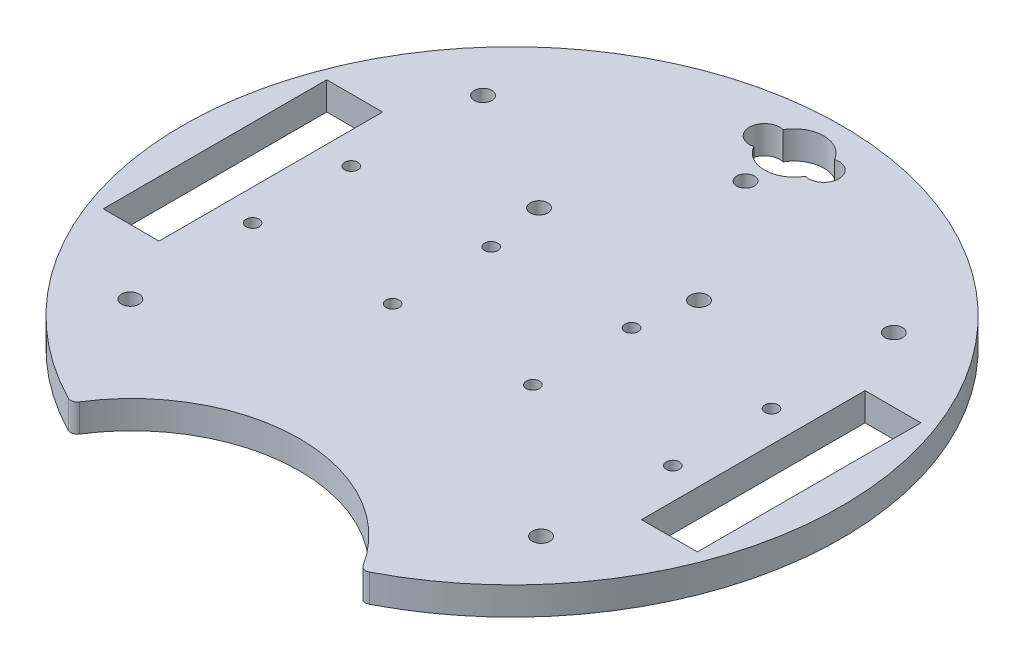
ISO-10303-21;
HEADER;
FILE_DESCRIPTION(('STEP AP214'),'2;1');
FILE_NAME('part.step','',(''),(''),'','','');
FILE_SCHEMA(('AUTOMOTIVE_DESIGN { 1 0 10303 214 1 1 1 1 }'));
ENDSEC;
DATA;
#1=APPLICATION_CONTEXT('core data for automotive mechanical design processes');
#2=APPLICATION_PROTOCOL_DEFINITION('international standard','automotive_design',2000,#1);
#3=PRODUCT_CONTEXT('',#1,'mechanical');
#4=PRODUCT('Part','Part','',(#3));
#5=PRODUCT_RELATED_PRODUCT_CATEGORY('part','',(#4));
#6=PRODUCT_DEFINITION_FORMATION('','',#4);
#7=PRODUCT_DEFINITION_CONTEXT('part definition',#1,'design');
#8=PRODUCT_DEFINITION('design','',#6,#7);
#9=PRODUCT_DEFINITION_SHAPE('','',#8);
#10=(LENGTH_UNIT() NAMED_UNIT(*) SI_UNIT(.MILLI.,.METRE.));
#11=(NAMED_UNIT(*) PLANE_ANGLE_UNIT() SI_UNIT($,.RADIAN.));
#12=(NAMED_UNIT(*) SI_UNIT($,.STERADIAN.) SOLID_ANGLE_UNIT());
#13=UNCERTAINTY_MEASURE_WITH_UNIT(LENGTH_MEASURE(1.E-05),#10,'distance_accuracy_value','');
#14=(GEOMETRIC_REPRESENTATION_CONTEXT(3) GLOBAL_UNCERTAINTY_ASSIGNED_CONTEXT((#13)) GLOBAL_UNIT_ASSIGNED_CONTEXT((#10,
#11,#12)) REPRESENTATION_CONTEXT('',''));
#15=CARTESIAN_POINT('',(0.,0.,0.));
#16=DIRECTION('',(0.,0.,1.));
#17=DIRECTION('',(1.,0.,0.));
#18=AXIS2_PLACEMENT_3D('',#15,#16,#17);
#19=CARTESIAN_POINT('',(0.,6.35,-64.1076988434385));
#20=DIRECTION('',(0.,-1.,0.));
#21=DIRECTION('',(0.,0.,-1.));
#22=AXIS2_PLACEMENT_3D('',#19,#20,#21);
#23=CYLINDRICAL_SURFACE('',#22,6.731);
#24=CARTESIAN_POINT('',(0.,0.,-64.1076988434385));
#25=DIRECTION('',(0.,1.,0.));
#26=DIRECTION('',(0.,0.,1.));
#27=AXIS2_PLACEMENT_3D('',#24,#25,#26);
#28=CIRCLE('',#27,6.731);
#29=CARTESIAN_POINT('',(-5.85389998799957,0.,-60.7853177800295));
#30=VERTEX_POINT('',#29);
#31=CARTESIAN_POINT('',(5.85757547169812,0.,-60.7918021934567));
#32=VERTEX_POINT('',#31);
#33=EDGE_CURVE('E235',#30,#32,#28,.T.);
#34=ORIENTED_EDGE('',*,*,#33,.F.);
#35=DIRECTION('',(0.,-1.,0.));
#36=VECTOR('',#35,1.);
#37=CARTESIAN_POINT('',(-5.85389998799957,6.35,-60.7853177800295));
#38=LINE('',#37,#36);
#39=CARTESIAN_POINT('',(-5.85389998799957,6.35,-60.7853177800295));
#40=VERTEX_POINT('',#39);
#41=EDGE_CURVE('E11',#40,#30,#38,.T.);
#42=ORIENTED_EDGE('',*,*,#41,.F.);
#43=CARTESIAN_POINT('',(0.,6.35,-64.1076988434385));
#44=DIRECTION('',(0.,1.,0.));
#45=DIRECTION('',(0.,0.,1.));
#46=AXIS2_PLACEMENT_3D('',#43,#44,#45);
#47=CIRCLE('',#46,6.731);
#48=CARTESIAN_POINT('',(5.85757547169812,6.35,-60.7918021934567));
#49=VERTEX_POINT('',#48);
#50=EDGE_CURVE('E169',#40,#49,#47,.T.);
#51=ORIENTED_EDGE('',*,*,#50,.T.);
#52=DIRECTION('',(0.,-1.,0.));
#53=VECTOR('',#52,1.);
#54=CARTESIAN_POINT('',(5.85757547169812,6.35,-60.7918021934567));
#55=LINE('',#54,#53);
#56=EDGE_CURVE('E52',#49,#32,#55,.T.);
#57=ORIENTED_EDGE('',*,*,#56,.T.);
#58=EDGE_LOOP('',(#34,#42,#51,#57));
#59=FACE_BOUND('',#58,.T.);
#60=ADVANCED_FACE('F33',(#59),#23,.F.);
#61=CARTESIAN_POINT('',(-6.731,6.35,-64.1076988434385));
#62=DIRECTION('',(0.,-1.,0.));
#63=DIRECTION('',(0.,0.,-1.));
#64=AXIS2_PLACEMENT_3D('',#61,#62,#63);
#65=CYLINDRICAL_SURFACE('',#64,3.43620726405579);
#66=CARTESIAN_POINT('',(-6.731,0.,-64.1076988434385));
#67=DIRECTION('',(0.,1.,0.));
#68=DIRECTION('',(0.,0.,1.));
#69=AXIS2_PLACEMENT_3D('',#66,#67,#68);
#70=CIRCLE('',#69,3.43620726405579);
#71=CARTESIAN_POINT('',(-5.85389998799957,0.,-67.4300799068475));
#72=VERTEX_POINT('',#71);
#73=EDGE_CURVE('E157',#72,#30,#70,.T.);
#74=ORIENTED_EDGE('',*,*,#73,.F.);
#75=DIRECTION('',(0.,-1.,0.));
#76=VECTOR('',#75,1.);
#77=CARTESIAN_POINT('',(-5.85389998799957,6.35,-67.4300799068475));
#78=LINE('',#77,#76);
#79=CARTESIAN_POINT('',(-5.85389998799957,6.35,-67.4300799068475));
#80=VERTEX_POINT('',#79);
#81=EDGE_CURVE('E43',#80,#72,#78,.T.);
#82=ORIENTED_EDGE('',*,*,#81,.F.);
#83=CARTESIAN_POINT('',(-6.731,6.35,-64.1076988434385));
#84=DIRECTION('',(0.,1.,0.));
#85=DIRECTION('',(0.,0.,1.));
#86=AXIS2_PLACEMENT_3D('',#83,#84,#85);
#87=CIRCLE('',#86,3.43620726405579);
#88=EDGE_CURVE('E155',#80,#40,#87,.T.);
#89=ORIENTED_EDGE('',*,*,#88,.T.);
#90=ORIENTED_EDGE('',*,*,#41,.T.);
#91=EDGE_LOOP('',(#74,#82,#89,#90));
#92=FACE_BOUND('',#91,.T.);
#93=ADVANCED_FACE('F154',(#92),#65,.F.);
#94=CARTESIAN_POINT('',(0.,6.35,-64.1076988434385));
#95=DIRECTION('',(0.,-1.,0.));
#96=DIRECTION('',(0.,0.,-1.));
#97=AXIS2_PLACEMENT_3D('',#94,#95,#96);
#98=CYLINDRICAL_SURFACE('',#97,6.731);
#99=CARTESIAN_POINT('',(0.,0.,-64.1076988434385));
#100=DIRECTION('',(0.,1.,0.));
#101=DIRECTION('',(0.,0.,1.));
#102=AXIS2_PLACEMENT_3D('',#99,#100,#101);
#103=CIRCLE('',#102,6.731);
#104=CARTESIAN_POINT('',(5.8575754716981,0.,-67.4235954934203));
#105=VERTEX_POINT('',#104);
#106=EDGE_CURVE('E238',#105,#72,#103,.T.);
#107=ORIENTED_EDGE('',*,*,#106,.F.);
#108=DIRECTION('',(0.,-1.,0.));
#109=VECTOR('',#108,1.);
#110=CARTESIAN_POINT('',(5.8575754716981,6.35,-67.4235954934203));
#111=LINE('',#110,#109);
#112=CARTESIAN_POINT('',(5.8575754716981,6.35,-67.4235954934203));
#113=VERTEX_POINT('',#112);
#114=EDGE_CURVE('E101',#113,#105,#111,.T.);
#115=ORIENTED_EDGE('',*,*,#114,.F.);
#116=CARTESIAN_POINT('',(0.,6.35,-64.1076988434385));
#117=DIRECTION('',(0.,1.,0.));
#118=DIRECTION('',(0.,0.,1.));
#119=AXIS2_PLACEMENT_3D('',#116,#117,#118);
#120=CIRCLE('',#119,6.731);
#121=EDGE_CURVE('E168',#113,#80,#120,.T.);
#122=ORIENTED_EDGE('',*,*,#121,.T.);
#123=ORIENTED_EDGE('',*,*,#81,.T.);
#124=EDGE_LOOP('',(#107,#115,#122,#123));
#125=FACE_BOUND('',#124,.T.);
#126=ADVANCED_FACE('F171',(#125),#98,.F.);
#127=CARTESIAN_POINT('',(0.,6.35,-25.4000000000001));
#128=DIRECTION('',(0.,0.,-1.));
#129=DIRECTION('',(-1.,0.,0.));
#130=AXIS2_PLACEMENT_3D('',#127,#128,#129);
#131=PLANE('',#130);
#132=DIRECTION('',(1.,0.,0.));
#133=VECTOR('',#132,1.);
#134=CARTESIAN_POINT('',(0.,0.,-25.4000000000001));
#135=LINE('',#134,#133);
#136=CARTESIAN_POINT('',(-67.5141237268841,0.,-25.4000000000001));
#137=VERTEX_POINT('',#136);
#138=CARTESIAN_POINT('',(-54.8141237268841,0.,-25.4000000000001));
#139=VERTEX_POINT('',#138);
#140=EDGE_CURVE('E224',#137,#139,#135,.T.);
#141=ORIENTED_EDGE('',*,*,#140,.T.);
#142=DIRECTION('',(0.,-1.,0.));
#143=VECTOR('',#142,1.);
#144=CARTESIAN_POINT('',(-54.8141237268841,6.35,-25.4000000000001));
#145=LINE('',#144,#143);
#146=CARTESIAN_POINT('',(-54.8141237268841,6.35,-25.4000000000001));
#147=VERTEX_POINT('',#146);
#148=EDGE_CURVE('E251',#147,#139,#145,.T.);
#149=ORIENTED_EDGE('',*,*,#148,.F.);
#150=DIRECTION('',(1.,0.,0.));
#151=VECTOR('',#150,1.);
#152=CARTESIAN_POINT('',(0.,6.35,-25.4000000000001));
#153=LINE('',#152,#151);
#154=CARTESIAN_POINT('',(-67.5141237268841,6.35,-25.4000000000001));
#155=VERTEX_POINT('',#154);
#156=EDGE_CURVE('E688',#155,#147,#153,.T.);
#157=ORIENTED_EDGE('',*,*,#156,.F.);
#158=DIRECTION('',(0.,-1.,0.));
#159=VECTOR('',#158,1.);
#160=CARTESIAN_POINT('',(-67.5141237268841,6.35,-25.4000000000001));
#161=LINE('',#160,#159);
#162=EDGE_CURVE('E253',#155,#137,#161,.T.);
#163=ORIENTED_EDGE('',*,*,#162,.T.);
#164=EDGE_LOOP('',(#141,#149,#157,#163));
#165=FACE_BOUND('',#164,.T.);
#166=ADVANCED_FACE('F329',(#165),#131,.F.);
#167=CARTESIAN_POINT('',(-54.8141237268841,6.35,0.));
#168=DIRECTION('',(1.,0.,0.));
#169=DIRECTION('',(0.,0.,-1.));
#170=AXIS2_PLACEMENT_3D('',#167,#168,#169);
#171=PLANE('',#170);
#172=DIRECTION('',(0.,0.,1.));
#173=VECTOR('',#172,1.);
#174=CARTESIAN_POINT('',(-54.8141237268841,0.,0.));
#175=LINE('',#174,#173);
#176=CARTESIAN_POINT('',(-54.8141237268841,0.,25.3999999999999));
#177=VERTEX_POINT('',#176);
#178=EDGE_CURVE('E227',#139,#177,#175,.T.);
#179=ORIENTED_EDGE('',*,*,#178,.T.);
#180=DIRECTION('',(0.,-1.,0.));
#181=VECTOR('',#180,1.);
#182=CARTESIAN_POINT('',(-54.8141237268841,6.35,25.3999999999999));
#183=LINE('',#182,#181);
#184=CARTESIAN_POINT('',(-54.8141237268841,6.35,25.3999999999999));
#185=VERTEX_POINT('',#184);
#186=EDGE_CURVE('E259',#185,#177,#183,.T.);
#187=ORIENTED_EDGE('',*,*,#186,.F.);
#188=DIRECTION('',(0.,0.,1.));
#189=VECTOR('',#188,1.);
#190=CARTESIAN_POINT('',(-54.8141237268841,6.35,0.));
#191=LINE('',#190,#189);
#192=EDGE_CURVE('E691',#147,#185,#191,.T.);
#193=ORIENTED_EDGE('',*,*,#192,.F.);
#194=ORIENTED_EDGE('',*,*,#148,.T.);
#195=EDGE_LOOP('',(#179,#187,#193,#194));
#196=FACE_BOUND('',#195,.T.);
#197=ADVANCED_FACE('F325',(#196),#171,.F.);
#198=CARTESIAN_POINT('',(0.,6.35,25.3999999999999));
#199=DIRECTION('',(0.,0.,-1.));
#200=DIRECTION('',(-1.,0.,0.));
#201=AXIS2_PLACEMENT_3D('',#198,#199,#200);
#202=PLANE('',#201);
#203=DIRECTION('',(1.,0.,0.));
#204=VECTOR('',#203,1.);
#205=CARTESIAN_POINT('',(0.,0.,25.3999999999999));
#206=LINE('',#205,#204);
#207=CARTESIAN_POINT('',(-67.5141237268841,0.,25.3999999999999));
#208=VERTEX_POINT('',#207);
#209=EDGE_CURVE('E230',#208,#177,#206,.T.);
#210=ORIENTED_EDGE('',*,*,#209,.F.);
#211=DIRECTION('',(0.,-1.,0.));
#212=VECTOR('',#211,1.);
#213=CARTESIAN_POINT('',(-67.5141237268841,6.35,25.3999999999999));
#214=LINE('',#213,#212);
#215=CARTESIAN_POINT('',(-67.5141237268841,6.35,25.3999999999999));
#216=VERTEX_POINT('',#215);
#217=EDGE_CURVE('E256',#216,#208,#214,.T.);
#218=ORIENTED_EDGE('',*,*,#217,.F.);
#219=DIRECTION('',(1.,0.,0.));
#220=VECTOR('',#219,1.);
#221=CARTESIAN_POINT('',(0.,6.35,25.3999999999999));
#222=LINE('',#221,#220);
#223=EDGE_CURVE('E693',#216,#185,#222,.T.);
#224=ORIENTED_EDGE('',*,*,#223,.T.);
#225=ORIENTED_EDGE('',*,*,#186,.T.);
#226=EDGE_LOOP('',(#210,#218,#224,#225));
#227=FACE_BOUND('',#226,.T.);
#228=ADVANCED_FACE('F321',(#227),#202,.T.);
#229=CARTESIAN_POINT('',(67.5141237268841,6.35,0.));
#230=DIRECTION('',(-1.,0.,0.));
#231=DIRECTION('',(0.,0.,1.));
#232=AXIS2_PLACEMENT_3D('',#229,#230,#231);
#233=PLANE('',#232);
#234=DIRECTION('',(0.,0.,-1.));
#235=VECTOR('',#234,1.);
#236=CARTESIAN_POINT('',(67.5141237268841,0.,0.));
#237=LINE('',#236,#235);
#238=CARTESIAN_POINT('',(67.5141237268841,0.,25.3999999999999));
#239=VERTEX_POINT('',#238);
#240=CARTESIAN_POINT('',(67.5141237268841,0.,-25.4000000000001));
#241=VERTEX_POINT('',#240);
#242=EDGE_CURVE('E212',#239,#241,#237,.T.);
#243=ORIENTED_EDGE('',*,*,#242,.F.);
#244=DIRECTION('',(0.,-1.,0.));
#245=VECTOR('',#244,1.);
#246=CARTESIAN_POINT('',(67.5141237268841,6.35,25.3999999999999));
#247=LINE('',#246,#245);
#248=CARTESIAN_POINT('',(67.5141237268841,6.35,25.3999999999999));
#249=VERTEX_POINT('',#248);
#250=EDGE_CURVE('E257',#249,#239,#247,.T.);
#251=ORIENTED_EDGE('',*,*,#250,.F.);
#252=DIRECTION('',(0.,0.,-1.));
#253=VECTOR('',#252,1.);
#254=CARTESIAN_POINT('',(67.5141237268841,6.35,0.));
#255=LINE('',#254,#253);
#256=CARTESIAN_POINT('',(67.5141237268841,6.35,-25.4000000000001));
#257=VERTEX_POINT('',#256);
#258=EDGE_CURVE('E677',#249,#257,#255,.T.);
#259=ORIENTED_EDGE('',*,*,#258,.T.);
#260=DIRECTION('',(0.,-1.,0.));
#261=VECTOR('',#260,1.);
#262=CARTESIAN_POINT('',(67.5141237268841,6.35,-25.4000000000001));
#263=LINE('',#262,#261);
#264=EDGE_CURVE('E263',#257,#241,#263,.T.);
#265=ORIENTED_EDGE('',*,*,#264,.T.);
#266=EDGE_LOOP('',(#243,#251,#259,#265));
#267=FACE_BOUND('',#266,.T.);
#268=ADVANCED_FACE('F324',(#267),#233,.T.);
#269=CARTESIAN_POINT('',(0.,6.35,25.3999999999999));
#270=DIRECTION('',(0.,0.,1.));
#271=DIRECTION('',(1.,0.,0.));
#272=AXIS2_PLACEMENT_3D('',#269,#270,#271);
#273=PLANE('',#272);
#274=DIRECTION('',(-1.,0.,0.));
#275=VECTOR('',#274,1.);
#276=CARTESIAN_POINT('',(0.,0.,25.3999999999999));
#277=LINE('',#276,#275);
#278=CARTESIAN_POINT('',(54.8141237268841,0.,25.3999999999999));
#279=VERTEX_POINT('',#278);
#280=EDGE_CURVE('E215',#239,#279,#277,.T.);
#281=ORIENTED_EDGE('',*,*,#280,.T.);
#282=DIRECTION('',(0.,-1.,0.));
#283=VECTOR('',#282,1.);
#284=CARTESIAN_POINT('',(54.8141237268841,6.35,25.3999999999999));
#285=LINE('',#284,#283);
#286=CARTESIAN_POINT('',(54.8141237268841,6.35,25.3999999999999));
#287=VERTEX_POINT('',#286);
#288=EDGE_CURVE('E267',#287,#279,#285,.T.);
#289=ORIENTED_EDGE('',*,*,#288,.F.);
#290=DIRECTION('',(-1.,0.,0.));
#291=VECTOR('',#290,1.);
#292=CARTESIAN_POINT('',(0.,6.35,25.3999999999999));
#293=LINE('',#292,#291);
#294=EDGE_CURVE('E680',#249,#287,#293,.T.);
#295=ORIENTED_EDGE('',*,*,#294,.F.);
#296=ORIENTED_EDGE('',*,*,#250,.T.);
#297=EDGE_LOOP('',(#281,#289,#295,#296));
#298=FACE_BOUND('',#297,.T.);
#299=ADVANCED_FACE('F341',(#298),#273,.F.);
#300=CARTESIAN_POINT('',(54.8141237268841,6.35,0.));
#301=DIRECTION('',(-1.,0.,0.));
#302=DIRECTION('',(0.,0.,1.));
#303=AXIS2_PLACEMENT_3D('',#300,#301,#302);
#304=PLANE('',#303);
#305=DIRECTION('',(0.,0.,-1.));
#306=VECTOR('',#305,1.);
#307=CARTESIAN_POINT('',(54.8141237268841,0.,0.));
#308=LINE('',#307,#306);
#309=CARTESIAN_POINT('',(54.8141237268841,0.,-25.4000000000001));
#310=VERTEX_POINT('',#309);
#311=EDGE_CURVE('E218',#279,#310,#308,.T.);
#312=ORIENTED_EDGE('',*,*,#311,.T.);
#313=DIRECTION('',(0.,-1.,0.));
#314=VECTOR('',#313,1.);
#315=CARTESIAN_POINT('',(54.8141237268841,6.35,-25.4000000000001));
#316=LINE('',#315,#314);
#317=CARTESIAN_POINT('',(54.8141237268841,6.35,-25.4000000000001));
#318=VERTEX_POINT('',#317);
#319=EDGE_CURVE('E265',#318,#310,#316,.T.);
#320=ORIENTED_EDGE('',*,*,#319,.F.);
#321=DIRECTION('',(0.,0.,-1.));
#322=VECTOR('',#321,1.);
#323=CARTESIAN_POINT('',(54.8141237268841,6.35,0.));
#324=LINE('',#323,#322);
#325=EDGE_CURVE('E683',#287,#318,#324,.T.);
#326=ORIENTED_EDGE('',*,*,#325,.F.);
#327=ORIENTED_EDGE('',*,*,#288,.T.);
#328=EDGE_LOOP('',(#312,#320,#326,#327));
#329=FACE_BOUND('',#328,.T.);
#330=ADVANCED_FACE('F338',(#329),#304,.F.);
#331=CARTESIAN_POINT('',(33.5100001196225,6.35,65.3012960955778));
#332=DIRECTION('',(0.,-1.,0.));
#333=DIRECTION('',(0.,0.,-1.));
#334=AXIS2_PLACEMENT_3D('',#331,#332,#333);
#335=CYLINDRICAL_SURFACE('',#334,1.50000000000011);
#336=CARTESIAN_POINT('',(33.5100001196225,0.,65.3012960955778));
#337=DIRECTION('',(0.,1.,0.));
#338=DIRECTION('',(0.,0.,1.));
#339=AXIS2_PLACEMENT_3D('',#336,#337,#338);
#340=CIRCLE('',#339,1.50000000000011);
#341=CARTESIAN_POINT('',(34.1948335778492,0.,66.6358383895849));
#342=VERTEX_POINT('',#341);
#343=CARTESIAN_POINT('',(32.2406819332729,0.,66.100565350462));
#344=VERTEX_POINT('',#343);
#345=EDGE_CURVE('E191',#342,#344,#340,.F.);
#346=ORIENTED_EDGE('',*,*,#345,.F.);
#347=DIRECTION('',(0.,-1.,0.));
#348=VECTOR('',#347,1.);
#349=CARTESIAN_POINT('',(34.1948335778492,6.35,66.6358383895849));
#350=LINE('',#349,#348);
#351=CARTESIAN_POINT('',(34.1948335778492,6.35,66.6358383895849));
#352=VERTEX_POINT('',#351);
#353=EDGE_CURVE('E37',#352,#342,#350,.T.);
#354=ORIENTED_EDGE('',*,*,#353,.F.);
#355=CARTESIAN_POINT('',(33.5100001196225,6.35,65.3012960955778));
#356=DIRECTION('',(0.,1.,0.));
#357=DIRECTION('',(0.,0.,1.));
#358=AXIS2_PLACEMENT_3D('',#355,#356,#357);
#359=CIRCLE('',#358,1.50000000000011);
#360=CARTESIAN_POINT('',(32.2406819332729,6.35,66.100565350462));
#361=VERTEX_POINT('',#360);
#362=EDGE_CURVE('E288',#352,#361,#359,.F.);
#363=ORIENTED_EDGE('',*,*,#362,.T.);
#364=DIRECTION('',(0.,-1.,0.));
#365=VECTOR('',#364,1.);
#366=CARTESIAN_POINT('',(32.2406819332729,6.35,66.100565350462));
#367=LINE('',#366,#365);
#368=EDGE_CURVE('E183',#361,#344,#367,.T.);
#369=ORIENTED_EDGE('',*,*,#368,.T.);
#370=EDGE_LOOP('',(#346,#354,#363,#369));
#371=FACE_BOUND('',#370,.T.);
#372=ADVANCED_FACE('F287',(#371),#335,.T.);
#373=CARTESIAN_POINT('',(0.,6.35,0.));
#374=DIRECTION('',(0.,-1.,0.));
#375=DIRECTION('',(0.,0.,-1.));
#376=AXIS2_PLACEMENT_3D('',#373,#374,#375);
#377=CYLINDRICAL_SURFACE('',#376,74.8974071734108);
#378=CARTESIAN_POINT('',(0.,0.,0.));
#379=DIRECTION('',(0.,1.,0.));
#380=DIRECTION('',(0.,0.,1.));
#381=AXIS2_PLACEMENT_3D('',#378,#379,#380);
#382=CIRCLE('',#381,74.8974071734108);
#383=CARTESIAN_POINT('',(-34.1948335778492,0.,66.6358383895849));
#384=VERTEX_POINT('',#383);
#385=EDGE_CURVE('E194',#342,#384,#382,.T.);
#386=ORIENTED_EDGE('',*,*,#385,.T.);
#387=DIRECTION('',(0.,-1.,0.));
#388=VECTOR('',#387,1.);
#389=CARTESIAN_POINT('',(-34.1948335778492,6.35,66.6358383895849));
#390=LINE('',#389,#388);
#391=CARTESIAN_POINT('',(-34.1948335778492,6.35,66.6358383895849));
#392=VERTEX_POINT('',#391);
#393=EDGE_CURVE('E273',#392,#384,#390,.T.);
#394=ORIENTED_EDGE('',*,*,#393,.F.);
#395=CARTESIAN_POINT('',(0.,6.35,0.));
#396=DIRECTION('',(0.,1.,0.));
#397=DIRECTION('',(0.,0.,1.));
#398=AXIS2_PLACEMENT_3D('',#395,#396,#397);
#399=CIRCLE('',#398,74.8974071734108);
#400=EDGE_CURVE('E281',#352,#392,#399,.T.);
#401=ORIENTED_EDGE('',*,*,#400,.F.);
#402=ORIENTED_EDGE('',*,*,#353,.T.);
#403=EDGE_LOOP('',(#386,#394,#401,#402));
#404=FACE_BOUND('',#403,.T.);
#405=ADVANCED_FACE('F279',(#404),#377,.T.);
#406=CARTESIAN_POINT('',(-33.5100001196225,6.35,65.3012960955779));
#407=DIRECTION('',(0.,-1.,0.));
#408=DIRECTION('',(0.,0.,-1.));
#409=AXIS2_PLACEMENT_3D('',#406,#407,#408);
#410=CYLINDRICAL_SURFACE('',#409,1.50000000000026);
#411=CARTESIAN_POINT('',(-33.5100001196225,0.,65.3012960955779));
#412=DIRECTION('',(0.,1.,0.));
#413=DIRECTION('',(0.,0.,1.));
#414=AXIS2_PLACEMENT_3D('',#411,#412,#413);
#415=CIRCLE('',#414,1.50000000000026);
#416=CARTESIAN_POINT('',(-32.2406819332729,0.,66.100565350462));
#417=VERTEX_POINT('',#416);
#418=EDGE_CURVE('E197',#384,#417,#415,.T.);
#419=ORIENTED_EDGE('',*,*,#418,.T.);
#420=DIRECTION('',(0.,-1.,0.));
#421=VECTOR('',#420,1.);
#422=CARTESIAN_POINT('',(-32.2406819332729,6.35,66.100565350462));
#423=LINE('',#422,#421);
#424=CARTESIAN_POINT('',(-32.2406819332729,6.35,66.100565350462));
#425=VERTEX_POINT('',#424);
#426=EDGE_CURVE('E272',#425,#417,#423,.T.);
#427=ORIENTED_EDGE('',*,*,#426,.F.);
#428=CARTESIAN_POINT('',(-33.5100001196225,6.35,65.3012960955779));
#429=DIRECTION('',(0.,1.,0.));
#430=DIRECTION('',(0.,0.,1.));
#431=AXIS2_PLACEMENT_3D('',#428,#429,#430);
#432=CIRCLE('',#431,1.50000000000026);
#433=EDGE_CURVE('E665',#392,#425,#432,.T.);
#434=ORIENTED_EDGE('',*,*,#433,.F.);
#435=ORIENTED_EDGE('',*,*,#393,.T.);
#436=EDGE_LOOP('',(#419,#427,#434,#435));
#437=FACE_BOUND('',#436,.T.);
#438=ADVANCED_FACE('F295',(#437),#410,.T.);
#439=CARTESIAN_POINT('',(-18.1789527954067,6.35,-24.3105510962522));
#440=DIRECTION('',(0.,-1.,0.));
#441=DIRECTION('',(0.,0.,-1.));
#442=AXIS2_PLACEMENT_3D('',#439,#440,#441);
#443=CYLINDRICAL_SURFACE('',#442,2.);
#444=CARTESIAN_POINT('',(-18.1789527954067,6.35,-24.3105510962522));
#445=DIRECTION('',(0.,1.,0.));
#446=DIRECTION('',(0.,0.,1.));
#447=AXIS2_PLACEMENT_3D('',#444,#445,#446);
#448=CIRCLE('',#447,2.);
#449=CARTESIAN_POINT('',(-18.1789527954067,6.35,-22.3105510962522));
#450=VERTEX_POINT('',#449);
#451=EDGE_CURVE('E174',#450,#450,#448,.F.);
#452=ORIENTED_EDGE('',*,*,#451,.F.);
#453=EDGE_LOOP('',(#452));
#454=FACE_BOUND('',#453,.T.);
#455=CARTESIAN_POINT('',(-18.1789527954067,0.,-24.3105510962522));
#456=DIRECTION('',(0.,1.,0.));
#457=DIRECTION('',(0.,0.,1.));
#458=AXIS2_PLACEMENT_3D('',#455,#456,#457);
#459=CIRCLE('',#458,2.);
#460=CARTESIAN_POINT('',(-18.1789527954067,0.,-22.3105510962522));
#461=VERTEX_POINT('',#460);
#462=EDGE_CURVE('E243',#461,#461,#459,.F.);
#463=ORIENTED_EDGE('',*,*,#462,.T.);
#464=EDGE_LOOP('',(#463));
#465=FACE_BOUND('',#464,.T.);
#466=ADVANCED_FACE('F297',(#454,#465),#443,.F.);
#467=CARTESIAN_POINT('',(6.731,6.35,-64.1076988434385));
#468=DIRECTION('',(0.,-1.,0.));
#469=DIRECTION('',(0.,0.,-1.));
#470=AXIS2_PLACEMENT_3D('',#467,#468,#469);
#471=CYLINDRICAL_SURFACE('',#470,3.429);
#472=CARTESIAN_POINT('',(6.731,0.,-64.1076988434385));
#473=DIRECTION('',(0.,1.,0.));
#474=DIRECTION('',(0.,0.,1.));
#475=AXIS2_PLACEMENT_3D('',#472,#473,#474);
#476=CIRCLE('',#475,3.429);
#477=EDGE_CURVE('E240',#32,#105,#476,.T.);
#478=ORIENTED_EDGE('',*,*,#477,.F.);
#479=ORIENTED_EDGE('',*,*,#56,.F.);
#480=CARTESIAN_POINT('',(6.731,6.35,-64.1076988434385));
#481=DIRECTION('',(0.,1.,0.));
#482=DIRECTION('',(0.,0.,1.));
#483=AXIS2_PLACEMENT_3D('',#480,#481,#482);
#484=CIRCLE('',#483,3.429);
#485=EDGE_CURVE('E172',#49,#113,#484,.T.);
#486=ORIENTED_EDGE('',*,*,#485,.T.);
#487=ORIENTED_EDGE('',*,*,#114,.T.);
#488=EDGE_LOOP('',(#478,#479,#486,#487));
#489=FACE_BOUND('',#488,.T.);
#490=ADVANCED_FACE('F303',(#489),#471,.F.);
#491=CARTESIAN_POINT('',(-67.5141237268841,6.35,0.));
#492=DIRECTION('',(-1.,0.,0.));
#493=DIRECTION('',(0.,0.,1.));
#494=AXIS2_PLACEMENT_3D('',#491,#492,#493);
#495=PLANE('',#494);
#496=DIRECTION('',(0.,0.,-1.));
#497=VECTOR('',#496,1.);
#498=CARTESIAN_POINT('',(-67.5141237268841,0.,0.));
#499=LINE('',#498,#497);
#500=EDGE_CURVE('E233',#208,#137,#499,.T.);
#501=ORIENTED_EDGE('',*,*,#500,.T.);
#502=ORIENTED_EDGE('',*,*,#162,.F.);
#503=DIRECTION('',(0.,0.,-1.));
#504=VECTOR('',#503,1.);
#505=CARTESIAN_POINT('',(-67.5141237268841,6.35,0.));
#506=LINE('',#505,#504);
#507=EDGE_CURVE('E696',#216,#155,#506,.T.);
#508=ORIENTED_EDGE('',*,*,#507,.F.);
#509=ORIENTED_EDGE('',*,*,#217,.T.);
#510=EDGE_LOOP('',(#501,#502,#508,#509));
#511=FACE_BOUND('',#510,.T.);
#512=ADVANCED_FACE('F316',(#511),#495,.F.);
#513=CARTESIAN_POINT('',(0.,6.35,-25.4000000000001));
#514=DIRECTION('',(0.,0.,1.));
#515=DIRECTION('',(1.,0.,0.));
#516=AXIS2_PLACEMENT_3D('',#513,#514,#515);
#517=PLANE('',#516);
#518=DIRECTION('',(-1.,0.,0.));
#519=VECTOR('',#518,1.);
#520=CARTESIAN_POINT('',(0.,0.,-25.4000000000001));
#521=LINE('',#520,#519);
#522=EDGE_CURVE('E221',#241,#310,#521,.T.);
#523=ORIENTED_EDGE('',*,*,#522,.F.);
#524=ORIENTED_EDGE('',*,*,#264,.F.);
#525=DIRECTION('',(-1.,0.,0.));
#526=VECTOR('',#525,1.);
#527=CARTESIAN_POINT('',(0.,6.35,-25.4000000000001));
#528=LINE('',#527,#526);
#529=EDGE_CURVE('E685',#257,#318,#528,.T.);
#530=ORIENTED_EDGE('',*,*,#529,.T.);
#531=ORIENTED_EDGE('',*,*,#319,.T.);
#532=EDGE_LOOP('',(#523,#524,#530,#531));
#533=FACE_BOUND('',#532,.T.);
#534=ADVANCED_FACE('F319',(#533),#517,.T.);
#535=CARTESIAN_POINT('',(-46.6637339832601,6.35,40.0812318826666));
#536=DIRECTION('',(0.,-1.,0.));
#537=DIRECTION('',(0.,0.,-1.));
#538=AXIS2_PLACEMENT_3D('',#535,#536,#537);
#539=CYLINDRICAL_SURFACE('',#538,2.);
#540=CARTESIAN_POINT('',(-46.6637339832601,6.35,40.0812318826666));
#541=DIRECTION('',(0.,1.,0.));
#542=DIRECTION('',(0.,0.,1.));
#543=AXIS2_PLACEMENT_3D('',#540,#541,#542);
#544=CIRCLE('',#543,2.);
#545=CARTESIAN_POINT('',(-46.6637339832601,6.35,42.0812318826666));
#546=VERTEX_POINT('',#545);
#547=EDGE_CURVE('E674',#546,#546,#544,.T.);
#548=ORIENTED_EDGE('',*,*,#547,.T.);
#549=EDGE_LOOP('',(#548));
#550=FACE_BOUND('',#549,.T.);
#551=CARTESIAN_POINT('',(-46.6637339832601,0.,40.0812318826666));
#552=DIRECTION('',(0.,1.,0.));
#553=DIRECTION('',(0.,0.,1.));
#554=AXIS2_PLACEMENT_3D('',#551,#552,#553);
#555=CIRCLE('',#554,2.);
#556=CARTESIAN_POINT('',(-46.6637339832601,0.,42.0812318826666));
#557=VERTEX_POINT('',#556);
#558=EDGE_CURVE('E209',#557,#557,#555,.T.);
#559=ORIENTED_EDGE('',*,*,#558,.F.);
#560=EDGE_LOOP('',(#559));
#561=FACE_BOUND('',#560,.T.);
#562=ADVANCED_FACE('F336',(#550,#561),#539,.F.);
#563=CARTESIAN_POINT('',(46.6637339832601,6.35,40.0812318826666));
#564=DIRECTION('',(0.,-1.,0.));
#565=DIRECTION('',(0.,0.,-1.));
#566=AXIS2_PLACEMENT_3D('',#563,#564,#565);
#567=CYLINDRICAL_SURFACE('',#566,2.);
#568=CARTESIAN_POINT('',(46.6637339832601,6.35,40.0812318826666));
#569=DIRECTION('',(0.,1.,0.));
#570=DIRECTION('',(0.,0.,1.));
#571=AXIS2_PLACEMENT_3D('',#568,#569,#570);
#572=CIRCLE('',#571,2.);
#573=CARTESIAN_POINT('',(46.6637339832601,6.35,42.0812318826666));
#574=VERTEX_POINT('',#573);
#575=EDGE_CURVE('E671',#574,#574,#572,.T.);
#576=ORIENTED_EDGE('',*,*,#575,.T.);
#577=EDGE_LOOP('',(#576));
#578=FACE_BOUND('',#577,.T.);
#579=CARTESIAN_POINT('',(46.6637339832601,0.,40.0812318826666));
#580=DIRECTION('',(0.,1.,0.));
#581=DIRECTION('',(0.,0.,1.));
#582=AXIS2_PLACEMENT_3D('',#579,#580,#581);
#583=CIRCLE('',#582,2.);
#584=CARTESIAN_POINT('',(46.6637339832601,0.,42.0812318826666));
#585=VERTEX_POINT('',#584);
#586=EDGE_CURVE('E206',#585,#585,#583,.T.);
#587=ORIENTED_EDGE('',*,*,#586,.F.);
#588=EDGE_LOOP('',(#587));
#589=FACE_BOUND('',#588,.T.);
#590=ADVANCED_FACE('F351',(#578,#589),#567,.F.);
#591=CARTESIAN_POINT('',(46.6637339832601,6.35,-40.0812318826666));
#592=DIRECTION('',(0.,-1.,0.));
#593=DIRECTION('',(0.,0.,-1.));
#594=AXIS2_PLACEMENT_3D('',#591,#592,#593);
#595=CYLINDRICAL_SURFACE('',#594,2.);
#596=CARTESIAN_POINT('',(46.6637339832601,6.35,-40.0812318826666));
#597=DIRECTION('',(0.,1.,0.));
#598=DIRECTION('',(0.,0.,1.));
#599=AXIS2_PLACEMENT_3D('',#596,#597,#598);
#600=CIRCLE('',#599,2.);
#601=CARTESIAN_POINT('',(46.6637339832601,6.35,-38.0812318826666));
#602=VERTEX_POINT('',#601);
#603=EDGE_CURVE('E668',#602,#602,#600,.F.);
#604=ORIENTED_EDGE('',*,*,#603,.F.);
#605=EDGE_LOOP('',(#604));
#606=FACE_BOUND('',#605,.T.);
#607=CARTESIAN_POINT('',(46.6637339832601,0.,-40.0812318826666));
#608=DIRECTION('',(0.,1.,0.));
#609=DIRECTION('',(0.,0.,1.));
#610=AXIS2_PLACEMENT_3D('',#607,#608,#609);
#611=CIRCLE('',#610,2.);
#612=CARTESIAN_POINT('',(46.6637339832601,0.,-38.0812318826666));
#613=VERTEX_POINT('',#612);
#614=EDGE_CURVE('E203',#613,#613,#611,.F.);
#615=ORIENTED_EDGE('',*,*,#614,.T.);
#616=EDGE_LOOP('',(#615));
#617=FACE_BOUND('',#616,.T.);
#618=ADVANCED_FACE('F355',(#606,#617),#595,.F.);
#619=CARTESIAN_POINT('',(0.,6.35,86.4020044245157));
#620=DIRECTION('',(0.,-1.,0.));
#621=DIRECTION('',(0.,0.,-1.));
#622=AXIS2_PLACEMENT_3D('',#619,#620,#621);
#623=CYLINDRICAL_SURFACE('',#622,38.0999999999998);
#624=CARTESIAN_POINT('',(0.,0.,86.4020044245157));
#625=DIRECTION('',(0.,1.,0.));
#626=DIRECTION('',(0.,0.,1.));
#627=AXIS2_PLACEMENT_3D('',#624,#625,#626);
#628=CIRCLE('',#627,38.0999999999998);
#629=EDGE_CURVE('E200',#344,#417,#628,.T.);
#630=ORIENTED_EDGE('',*,*,#629,.F.);
#631=ORIENTED_EDGE('',*,*,#368,.F.);
#632=CARTESIAN_POINT('',(0.,6.35,86.4020044245157));
#633=DIRECTION('',(0.,1.,0.));
#634=DIRECTION('',(0.,0.,1.));
#635=AXIS2_PLACEMENT_3D('',#632,#633,#634);
#636=CIRCLE('',#635,38.0999999999998);
#637=EDGE_CURVE('E293',#361,#425,#636,.T.);
#638=ORIENTED_EDGE('',*,*,#637,.T.);
#639=ORIENTED_EDGE('',*,*,#426,.T.);
#640=EDGE_LOOP('',(#630,#631,#638,#639));
#641=FACE_BOUND('',#640,.T.);
#642=ADVANCED_FACE('F292',(#641),#623,.F.);
#643=CARTESIAN_POINT('',(18.1789527954067,6.35,-24.3105510962522));
#644=DIRECTION('',(0.,-1.,0.));
#645=DIRECTION('',(0.,0.,-1.));
#646=AXIS2_PLACEMENT_3D('',#643,#644,#645);
#647=CYLINDRICAL_SURFACE('',#646,2.);
#648=CARTESIAN_POINT('',(18.1789527954067,6.35,-24.3105510962522));
#649=DIRECTION('',(0.,1.,0.));
#650=DIRECTION('',(0.,0.,1.));
#651=AXIS2_PLACEMENT_3D('',#648,#649,#650);
#652=CIRCLE('',#651,2.);
#653=CARTESIAN_POINT('',(18.1789527954067,6.35,-22.3105510962522));
#654=VERTEX_POINT('',#653);
#655=EDGE_CURVE('E661',#654,#654,#652,.T.);
#656=ORIENTED_EDGE('',*,*,#655,.T.);
#657=EDGE_LOOP('',(#656));
#658=FACE_BOUND('',#657,.T.);
#659=CARTESIAN_POINT('',(18.1789527954067,0.,-24.3105510962522));
#660=DIRECTION('',(0.,1.,0.));
#661=DIRECTION('',(0.,0.,1.));
#662=AXIS2_PLACEMENT_3D('',#659,#660,#661);
#663=CIRCLE('',#662,2.);
#664=CARTESIAN_POINT('',(18.1789527954067,0.,-22.3105510962522));
#665=VERTEX_POINT('',#664);
#666=EDGE_CURVE('E187',#665,#665,#663,.T.);
#667=ORIENTED_EDGE('',*,*,#666,.F.);
#668=EDGE_LOOP('',(#667));
#669=FACE_BOUND('',#668,.T.);
#670=ADVANCED_FACE('F360',(#658,#669),#647,.F.);
#671=CARTESIAN_POINT('',(0.,6.35,-53.0611879648997));
#672=DIRECTION('',(0.,-1.,0.));
#673=DIRECTION('',(0.,0.,-1.));
#674=AXIS2_PLACEMENT_3D('',#671,#672,#673);
#675=CYLINDRICAL_SURFACE('',#674,2.);
#676=CARTESIAN_POINT('',(0.,6.35,-53.0611879648997));
#677=DIRECTION('',(0.,1.,0.));
#678=DIRECTION('',(0.,0.,1.));
#679=AXIS2_PLACEMENT_3D('',#676,#677,#678);
#680=CIRCLE('',#679,2.);
#681=CARTESIAN_POINT('',(0.,6.35,-51.0611879648997));
#682=VERTEX_POINT('',#681);
#683=EDGE_CURVE('E249',#682,#682,#680,.T.);
#684=ORIENTED_EDGE('',*,*,#683,.T.);
#685=EDGE_LOOP('',(#684));
#686=FACE_BOUND('',#685,.T.);
#687=CARTESIAN_POINT('',(0.,0.,-53.0611879648997));
#688=DIRECTION('',(0.,1.,0.));
#689=DIRECTION('',(0.,0.,1.));
#690=AXIS2_PLACEMENT_3D('',#687,#688,#689);
#691=CIRCLE('',#690,2.);
#692=CARTESIAN_POINT('',(0.,0.,-51.0611879648997));
#693=VERTEX_POINT('',#692);
#694=EDGE_CURVE('E184',#693,#693,#691,.T.);
#695=ORIENTED_EDGE('',*,*,#694,.F.);
#696=EDGE_LOOP('',(#695));
#697=FACE_BOUND('',#696,.T.);
#698=ADVANCED_FACE('F35',(#686,#697),#675,.F.);
#699=CARTESIAN_POINT('',(-46.6637339832601,6.35,-40.0812318826666));
#700=DIRECTION('',(0.,-1.,0.));
#701=DIRECTION('',(0.,0.,-1.));
#702=AXIS2_PLACEMENT_3D('',#699,#700,#701);
#703=CYLINDRICAL_SURFACE('',#702,2.);
#704=CARTESIAN_POINT('',(-46.6637339832601,6.35,-40.0812318826666));
#705=DIRECTION('',(0.,1.,0.));
#706=DIRECTION('',(0.,0.,1.));
#707=AXIS2_PLACEMENT_3D('',#704,#705,#706);
#708=CIRCLE('',#707,2.);
#709=CARTESIAN_POINT('',(-46.6637339832601,6.35,-38.0812318826666));
#710=VERTEX_POINT('',#709);
#711=EDGE_CURVE('E180',#710,#710,#708,.F.);
#712=ORIENTED_EDGE('',*,*,#711,.F.);
#713=EDGE_LOOP('',(#712));
#714=FACE_BOUND('',#713,.T.);
#715=CARTESIAN_POINT('',(-46.6637339832601,0.,-40.0812318826666));
#716=DIRECTION('',(0.,1.,0.));
#717=DIRECTION('',(0.,0.,1.));
#718=AXIS2_PLACEMENT_3D('',#715,#716,#717);
#719=CIRCLE('',#718,2.);
#720=CARTESIAN_POINT('',(-46.6637339832601,0.,-38.0812318826666));
#721=VERTEX_POINT('',#720);
#722=EDGE_CURVE('E246',#721,#721,#719,.F.);
#723=ORIENTED_EDGE('',*,*,#722,.T.);
#724=EDGE_LOOP('',(#723));
#725=FACE_BOUND('',#724,.T.);
#726=ADVANCED_FACE('F368',(#714,#725),#703,.F.);
#727=CARTESIAN_POINT('',(0.,6.35,0.));
#728=DIRECTION('',(0.,1.,0.));
#729=DIRECTION('',(0.,0.,1.));
#730=AXIS2_PLACEMENT_3D('',#727,#728,#729);
#731=PLANE('',#730);
#732=CARTESIAN_POINT('',(47.7457373660715,6.35,-11.205));
#733=DIRECTION('',(0.,1.,0.));
#734=DIRECTION('',(0.,0.,1.));
#735=AXIS2_PLACEMENT_3D('',#732,#733,#734);
#736=CIRCLE('',#735,1.5);
#737=CARTESIAN_POINT('',(47.7457373660715,6.35,-9.70499999999998));
#738=VERTEX_POINT('',#737);
#739=EDGE_CURVE('E611',#738,#738,#736,.F.);
#740=ORIENTED_EDGE('',*,*,#739,.T.);
#741=EDGE_LOOP('',(#740));
#742=FACE_BOUND('',#741,.T.);
#743=CARTESIAN_POINT('',(47.7457373660715,6.35,11.205));
#744=DIRECTION('',(0.,1.,0.));
#745=DIRECTION('',(0.,0.,1.));
#746=AXIS2_PLACEMENT_3D('',#743,#744,#745);
#747=CIRCLE('',#746,1.50000000000001);
#748=CARTESIAN_POINT('',(47.7457373660715,6.35,12.705));
#749=VERTEX_POINT('',#748);
#750=EDGE_CURVE('E621',#749,#749,#747,.F.);
#751=ORIENTED_EDGE('',*,*,#750,.T.);
#752=EDGE_LOOP('',(#751));
#753=FACE_BOUND('',#752,.T.);
#754=CARTESIAN_POINT('',(15.9457373660715,6.35,-11.2050000000004));
#755=DIRECTION('',(0.,1.,0.));
#756=DIRECTION('',(0.,0.,1.));
#757=AXIS2_PLACEMENT_3D('',#754,#755,#756);
#758=CIRCLE('',#757,1.5);
#759=CARTESIAN_POINT('',(15.9457373660715,6.35,-9.70500000000042));
#760=VERTEX_POINT('',#759);
#761=EDGE_CURVE('E627',#760,#760,#758,.F.);
#762=ORIENTED_EDGE('',*,*,#761,.T.);
#763=EDGE_LOOP('',(#762));
#764=FACE_BOUND('',#763,.T.);
#765=CARTESIAN_POINT('',(15.9457373660715,6.35,11.2050000000004));
#766=DIRECTION('',(0.,1.,0.));
#767=DIRECTION('',(0.,0.,1.));
#768=AXIS2_PLACEMENT_3D('',#765,#766,#767);
#769=CIRCLE('',#768,1.5);
#770=CARTESIAN_POINT('',(15.9457373660715,6.35,12.7050000000004));
#771=VERTEX_POINT('',#770);
#772=EDGE_CURVE('E633',#771,#771,#769,.F.);
#773=ORIENTED_EDGE('',*,*,#772,.T.);
#774=EDGE_LOOP('',(#773));
#775=FACE_BOUND('',#774,.T.);
#776=CARTESIAN_POINT('',(-15.9457373660715,6.35,11.2050000000004));
#777=DIRECTION('',(0.,1.,0.));
#778=DIRECTION('',(0.,0.,1.));
#779=AXIS2_PLACEMENT_3D('',#776,#777,#778);
#780=CIRCLE('',#779,1.5);
#781=CARTESIAN_POINT('',(-15.9457373660715,6.35,12.7050000000004));
#782=VERTEX_POINT('',#781);
#783=EDGE_CURVE('E639',#782,#782,#780,.F.);
#784=ORIENTED_EDGE('',*,*,#783,.T.);
#785=EDGE_LOOP('',(#784));
#786=FACE_BOUND('',#785,.T.);
#787=CARTESIAN_POINT('',(-15.9457373660715,6.35,-11.2050000000004));
#788=DIRECTION('',(0.,1.,0.));
#789=DIRECTION('',(0.,0.,1.));
#790=AXIS2_PLACEMENT_3D('',#787,#788,#789);
#791=CIRCLE('',#790,1.5);
#792=CARTESIAN_POINT('',(-15.9457373660715,6.35,-9.70500000000042));
#793=VERTEX_POINT('',#792);
#794=EDGE_CURVE('E645',#793,#793,#791,.F.);
#795=ORIENTED_EDGE('',*,*,#794,.T.);
#796=EDGE_LOOP('',(#795));
#797=FACE_BOUND('',#796,.T.);
#798=CARTESIAN_POINT('',(-47.7457373660715,6.35,11.205));
#799=DIRECTION('',(0.,1.,0.));
#800=DIRECTION('',(0.,0.,1.));
#801=AXIS2_PLACEMENT_3D('',#798,#799,#800);
#802=CIRCLE('',#801,1.50000000000001);
#803=CARTESIAN_POINT('',(-47.7457373660715,6.35,12.705));
#804=VERTEX_POINT('',#803);
#805=EDGE_CURVE('E651',#804,#804,#802,.F.);
#806=ORIENTED_EDGE('',*,*,#805,.T.);
#807=EDGE_LOOP('',(#806));
#808=FACE_BOUND('',#807,.T.);
#809=CARTESIAN_POINT('',(-47.7457373660715,6.35,-11.205));
#810=DIRECTION('',(0.,1.,0.));
#811=DIRECTION('',(0.,0.,1.));
#812=AXIS2_PLACEMENT_3D('',#809,#810,#811);
#813=CIRCLE('',#812,1.5);
#814=CARTESIAN_POINT('',(-47.7457373660715,6.35,-9.70499999999999));
#815=VERTEX_POINT('',#814);
#816=EDGE_CURVE('E188',#815,#815,#813,.F.);
#817=ORIENTED_EDGE('',*,*,#816,.T.);
#818=EDGE_LOOP('',(#817));
#819=FACE_BOUND('',#818,.T.);
#820=ORIENTED_EDGE('',*,*,#683,.F.);
#821=EDGE_LOOP('',(#820));
#822=FACE_BOUND('',#821,.T.);
#823=ORIENTED_EDGE('',*,*,#655,.F.);
#824=EDGE_LOOP('',(#823));
#825=FACE_BOUND('',#824,.T.);
#826=ORIENTED_EDGE('',*,*,#362,.F.);
#827=ORIENTED_EDGE('',*,*,#400,.T.);
#828=ORIENTED_EDGE('',*,*,#433,.T.);
#829=ORIENTED_EDGE('',*,*,#637,.F.);
#830=EDGE_LOOP('',(#826,#827,#828,#829));
#831=FACE_BOUND('',#830,.T.);
#832=ORIENTED_EDGE('',*,*,#603,.T.);
#833=EDGE_LOOP('',(#832));
#834=FACE_BOUND('',#833,.T.);
#835=ORIENTED_EDGE('',*,*,#575,.F.);
#836=EDGE_LOOP('',(#835));
#837=FACE_BOUND('',#836,.T.);
#838=ORIENTED_EDGE('',*,*,#547,.F.);
#839=EDGE_LOOP('',(#838));
#840=FACE_BOUND('',#839,.T.);
#841=ORIENTED_EDGE('',*,*,#258,.F.);
#842=ORIENTED_EDGE('',*,*,#294,.T.);
#843=ORIENTED_EDGE('',*,*,#325,.T.);
#844=ORIENTED_EDGE('',*,*,#529,.F.);
#845=EDGE_LOOP('',(#841,#842,#843,#844));
#846=FACE_BOUND('',#845,.T.);
#847=ORIENTED_EDGE('',*,*,#156,.T.);
#848=ORIENTED_EDGE('',*,*,#192,.T.);
#849=ORIENTED_EDGE('',*,*,#223,.F.);
#850=ORIENTED_EDGE('',*,*,#507,.T.);
#851=EDGE_LOOP('',(#847,#848,#849,#850));
#852=FACE_BOUND('',#851,.T.);
#853=ORIENTED_EDGE('',*,*,#50,.F.);
#854=ORIENTED_EDGE('',*,*,#88,.F.);
#855=ORIENTED_EDGE('',*,*,#121,.F.);
#856=ORIENTED_EDGE('',*,*,#485,.F.);
#857=EDGE_LOOP('',(#853,#854,#855,#856));
#858=FACE_BOUND('',#857,.T.);
#859=ORIENTED_EDGE('',*,*,#451,.T.);
#860=EDGE_LOOP('',(#859));
#861=FACE_BOUND('',#860,.T.);
#862=ORIENTED_EDGE('',*,*,#711,.T.);
#863=EDGE_LOOP('',(#862));
#864=FACE_BOUND('',#863,.T.);
#865=ADVANCED_FACE('F165',(#742,#753,#764,#775,#786,#797,#808,#819,#822,#825,#831,#834,#837,
#840,#846,#852,#858,#861,#864),#731,.T.);
#866=CARTESIAN_POINT('',(0.,0.,0.));
#867=DIRECTION('',(0.,1.,0.));
#868=DIRECTION('',(0.,0.,1.));
#869=AXIS2_PLACEMENT_3D('',#866,#867,#868);
#870=PLANE('',#869);
#871=CARTESIAN_POINT('',(47.7457373660715,0.,-11.205));
#872=DIRECTION('',(0.,1.,0.));
#873=DIRECTION('',(0.,0.,-1.));
#874=AXIS2_PLACEMENT_3D('',#871,#872,#873);
#875=CIRCLE('',#874,1.5);
#876=CARTESIAN_POINT('',(47.7457373660715,0.,-12.705));
#877=VERTEX_POINT('',#876);
#878=EDGE_CURVE('E614',#877,#877,#875,.T.);
#879=ORIENTED_EDGE('',*,*,#878,.T.);
#880=EDGE_LOOP('',(#879));
#881=FACE_BOUND('',#880,.T.);
#882=CARTESIAN_POINT('',(47.7457373660715,0.,11.205));
#883=DIRECTION('',(0.,1.,0.));
#884=DIRECTION('',(0.,0.,1.));
#885=AXIS2_PLACEMENT_3D('',#882,#883,#884);
#886=CIRCLE('',#885,1.50000000000001);
#887=CARTESIAN_POINT('',(47.7457373660715,0.,12.705));
#888=VERTEX_POINT('',#887);
#889=EDGE_CURVE('E616',#888,#888,#886,.T.);
#890=ORIENTED_EDGE('',*,*,#889,.T.);
#891=EDGE_LOOP('',(#890));
#892=FACE_BOUND('',#891,.T.);
#893=CARTESIAN_POINT('',(15.9457373660715,0.,-11.2050000000004));
#894=DIRECTION('',(0.,1.,0.));
#895=DIRECTION('',(0.,0.,-1.));
#896=AXIS2_PLACEMENT_3D('',#893,#894,#895);
#897=CIRCLE('',#896,1.5);
#898=CARTESIAN_POINT('',(15.9457373660715,0.,-12.7050000000004));
#899=VERTEX_POINT('',#898);
#900=EDGE_CURVE('E624',#899,#899,#897,.T.);
#901=ORIENTED_EDGE('',*,*,#900,.T.);
#902=EDGE_LOOP('',(#901));
#903=FACE_BOUND('',#902,.T.);
#904=CARTESIAN_POINT('',(15.9457373660715,0.,11.2050000000004));
#905=DIRECTION('',(0.,1.,0.));
#906=DIRECTION('',(0.,0.,1.));
#907=AXIS2_PLACEMENT_3D('',#904,#905,#906);
#908=CIRCLE('',#907,1.5);
#909=CARTESIAN_POINT('',(15.9457373660715,0.,12.7050000000004));
#910=VERTEX_POINT('',#909);
#911=EDGE_CURVE('E630',#910,#910,#908,.T.);
#912=ORIENTED_EDGE('',*,*,#911,.T.);
#913=EDGE_LOOP('',(#912));
#914=FACE_BOUND('',#913,.T.);
#915=CARTESIAN_POINT('',(-15.9457373660715,0.,11.2050000000004));
#916=DIRECTION('',(0.,1.,0.));
#917=DIRECTION('',(0.,0.,-1.));
#918=AXIS2_PLACEMENT_3D('',#915,#916,#917);
#919=CIRCLE('',#918,1.5);
#920=CARTESIAN_POINT('',(-15.9457373660715,0.,9.70500000000043));
#921=VERTEX_POINT('',#920);
#922=EDGE_CURVE('E636',#921,#921,#919,.T.);
#923=ORIENTED_EDGE('',*,*,#922,.T.);
#924=EDGE_LOOP('',(#923));
#925=FACE_BOUND('',#924,.T.);
#926=CARTESIAN_POINT('',(-15.9457373660715,0.,-11.2050000000004));
#927=DIRECTION('',(0.,1.,0.));
#928=DIRECTION('',(0.,0.,1.));
#929=AXIS2_PLACEMENT_3D('',#926,#927,#928);
#930=CIRCLE('',#929,1.5);
#931=CARTESIAN_POINT('',(-15.9457373660715,0.,-9.70500000000042));
#932=VERTEX_POINT('',#931);
#933=EDGE_CURVE('E642',#932,#932,#930,.T.);
#934=ORIENTED_EDGE('',*,*,#933,.T.);
#935=EDGE_LOOP('',(#934));
#936=FACE_BOUND('',#935,.T.);
#937=CARTESIAN_POINT('',(-47.7457373660715,0.,11.205));
#938=DIRECTION('',(0.,1.,0.));
#939=DIRECTION('',(0.,0.,-1.));
#940=AXIS2_PLACEMENT_3D('',#937,#938,#939);
#941=CIRCLE('',#940,1.50000000000001);
#942=CARTESIAN_POINT('',(-47.7457373660715,0.,9.70499999999999));
#943=VERTEX_POINT('',#942);
#944=EDGE_CURVE('E648',#943,#943,#941,.T.);
#945=ORIENTED_EDGE('',*,*,#944,.T.);
#946=EDGE_LOOP('',(#945));
#947=FACE_BOUND('',#946,.T.);
#948=CARTESIAN_POINT('',(-47.7457373660715,0.,-11.205));
#949=DIRECTION('',(0.,1.,0.));
#950=DIRECTION('',(0.,0.,1.));
#951=AXIS2_PLACEMENT_3D('',#948,#949,#950);
#952=CIRCLE('',#951,1.5);
#953=CARTESIAN_POINT('',(-47.7457373660715,0.,-9.70499999999999));
#954=VERTEX_POINT('',#953);
#955=EDGE_CURVE('E654',#954,#954,#952,.T.);
#956=ORIENTED_EDGE('',*,*,#955,.T.);
#957=EDGE_LOOP('',(#956));
#958=FACE_BOUND('',#957,.T.);
#959=ORIENTED_EDGE('',*,*,#694,.T.);
#960=EDGE_LOOP('',(#959));
#961=FACE_BOUND('',#960,.T.);
#962=ORIENTED_EDGE('',*,*,#666,.T.);
#963=EDGE_LOOP('',(#962));
#964=FACE_BOUND('',#963,.T.);
#965=ORIENTED_EDGE('',*,*,#345,.T.);
#966=ORIENTED_EDGE('',*,*,#629,.T.);
#967=ORIENTED_EDGE('',*,*,#418,.F.);
#968=ORIENTED_EDGE('',*,*,#385,.F.);
#969=EDGE_LOOP('',(#965,#966,#967,#968));
#970=FACE_BOUND('',#969,.T.);
#971=ORIENTED_EDGE('',*,*,#614,.F.);
#972=EDGE_LOOP('',(#971));
#973=FACE_BOUND('',#972,.T.);
#974=ORIENTED_EDGE('',*,*,#586,.T.);
#975=EDGE_LOOP('',(#974));
#976=FACE_BOUND('',#975,.T.);
#977=ORIENTED_EDGE('',*,*,#558,.T.);
#978=EDGE_LOOP('',(#977));
#979=FACE_BOUND('',#978,.T.);
#980=ORIENTED_EDGE('',*,*,#242,.T.);
#981=ORIENTED_EDGE('',*,*,#522,.T.);
#982=ORIENTED_EDGE('',*,*,#311,.F.);
#983=ORIENTED_EDGE('',*,*,#280,.F.);
#984=EDGE_LOOP('',(#980,#981,#982,#983));
#985=FACE_BOUND('',#984,.T.);
#986=ORIENTED_EDGE('',*,*,#140,.F.);
#987=ORIENTED_EDGE('',*,*,#500,.F.);
#988=ORIENTED_EDGE('',*,*,#209,.T.);
#989=ORIENTED_EDGE('',*,*,#178,.F.);
#990=EDGE_LOOP('',(#986,#987,#988,#989));
#991=FACE_BOUND('',#990,.T.);
#992=ORIENTED_EDGE('',*,*,#33,.T.);
#993=ORIENTED_EDGE('',*,*,#477,.T.);
#994=ORIENTED_EDGE('',*,*,#106,.T.);
#995=ORIENTED_EDGE('',*,*,#73,.T.);
#996=EDGE_LOOP('',(#992,#993,#994,#995));
#997=FACE_BOUND('',#996,.T.);
#998=ORIENTED_EDGE('',*,*,#462,.F.);
#999=EDGE_LOOP('',(#998));
#1000=FACE_BOUND('',#999,.T.);
#1001=ORIENTED_EDGE('',*,*,#722,.F.);
#1002=EDGE_LOOP('',(#1001));
#1003=FACE_BOUND('',#1002,.T.);
#1004=ADVANCED_FACE('F284',(#881,#892,#903,#914,#925,#936,#947,#958,#961,#964,#970,#973,#976,
#979,#985,#991,#997,#1000,#1003),#870,.F.);
#1005=CARTESIAN_POINT('',(-47.7457373660715,10.,-11.205));
#1006=DIRECTION('',(0.,-1.,0.));
#1007=DIRECTION('',(0.,0.,-1.));
#1008=AXIS2_PLACEMENT_3D('',#1005,#1006,#1007);
#1009=CYLINDRICAL_SURFACE('',#1008,1.5);
#1010=ORIENTED_EDGE('',*,*,#816,.F.);
#1011=EDGE_LOOP('',(#1010));
#1012=FACE_BOUND('',#1011,.T.);
#1013=ORIENTED_EDGE('',*,*,#955,.F.);
#1014=EDGE_LOOP('',(#1013));
#1015=FACE_BOUND('',#1014,.T.);
#1016=ADVANCED_FACE('F471',(#1012,#1015),#1009,.F.);
#1017=CARTESIAN_POINT('',(-47.7457373660715,10.,11.205));
#1018=DIRECTION('',(0.,-1.,0.));
#1019=DIRECTION('',(0.,0.,-1.));
#1020=AXIS2_PLACEMENT_3D('',#1017,#1018,#1019);
#1021=CYLINDRICAL_SURFACE('',#1020,1.50000000000001);
#1022=ORIENTED_EDGE('',*,*,#805,.F.);
#1023=EDGE_LOOP('',(#1022));
#1024=FACE_BOUND('',#1023,.T.);
#1025=ORIENTED_EDGE('',*,*,#944,.F.);
#1026=EDGE_LOOP('',(#1025));
#1027=FACE_BOUND('',#1026,.T.);
#1028=ADVANCED_FACE('F481',(#1024,#1027),#1021,.F.);
#1029=CARTESIAN_POINT('',(-15.9457373660715,10.,-11.2050000000004));
#1030=DIRECTION('',(0.,-1.,0.));
#1031=DIRECTION('',(0.,0.,-1.));
#1032=AXIS2_PLACEMENT_3D('',#1029,#1030,#1031);
#1033=CYLINDRICAL_SURFACE('',#1032,1.5);
#1034=ORIENTED_EDGE('',*,*,#794,.F.);
#1035=EDGE_LOOP('',(#1034));
#1036=FACE_BOUND('',#1035,.T.);
#1037=ORIENTED_EDGE('',*,*,#933,.F.);
#1038=EDGE_LOOP('',(#1037));
#1039=FACE_BOUND('',#1038,.T.);
#1040=ADVANCED_FACE('F491',(#1036,#1039),#1033,.F.);
#1041=CARTESIAN_POINT('',(-15.9457373660715,10.,11.2050000000004));
#1042=DIRECTION('',(0.,-1.,0.));
#1043=DIRECTION('',(0.,0.,-1.));
#1044=AXIS2_PLACEMENT_3D('',#1041,#1042,#1043);
#1045=CYLINDRICAL_SURFACE('',#1044,1.5);
#1046=ORIENTED_EDGE('',*,*,#783,.F.);
#1047=EDGE_LOOP('',(#1046));
#1048=FACE_BOUND('',#1047,.T.);
#1049=ORIENTED_EDGE('',*,*,#922,.F.);
#1050=EDGE_LOOP('',(#1049));
#1051=FACE_BOUND('',#1050,.T.);
#1052=ADVANCED_FACE('F501',(#1048,#1051),#1045,.F.);
#1053=CARTESIAN_POINT('',(15.9457373660715,10.,11.2050000000004));
#1054=DIRECTION('',(0.,-1.,0.));
#1055=DIRECTION('',(0.,0.,-1.));
#1056=AXIS2_PLACEMENT_3D('',#1053,#1054,#1055);
#1057=CYLINDRICAL_SURFACE('',#1056,1.5);
#1058=ORIENTED_EDGE('',*,*,#772,.F.);
#1059=EDGE_LOOP('',(#1058));
#1060=FACE_BOUND('',#1059,.T.);
#1061=ORIENTED_EDGE('',*,*,#911,.F.);
#1062=EDGE_LOOP('',(#1061));
#1063=FACE_BOUND('',#1062,.T.);
#1064=ADVANCED_FACE('F511',(#1060,#1063),#1057,.F.);
#1065=CARTESIAN_POINT('',(15.9457373660715,10.,-11.2050000000004));
#1066=DIRECTION('',(0.,-1.,0.));
#1067=DIRECTION('',(0.,0.,-1.));
#1068=AXIS2_PLACEMENT_3D('',#1065,#1066,#1067);
#1069=CYLINDRICAL_SURFACE('',#1068,1.5);
#1070=ORIENTED_EDGE('',*,*,#761,.F.);
#1071=EDGE_LOOP('',(#1070));
#1072=FACE_BOUND('',#1071,.T.);
#1073=ORIENTED_EDGE('',*,*,#900,.F.);
#1074=EDGE_LOOP('',(#1073));
#1075=FACE_BOUND('',#1074,.T.);
#1076=ADVANCED_FACE('F521',(#1072,#1075),#1069,.F.);
#1077=CARTESIAN_POINT('',(47.7457373660715,10.,11.205));
#1078=DIRECTION('',(0.,-1.,0.));
#1079=DIRECTION('',(0.,0.,-1.));
#1080=AXIS2_PLACEMENT_3D('',#1077,#1078,#1079);
#1081=CYLINDRICAL_SURFACE('',#1080,1.50000000000001);
#1082=ORIENTED_EDGE('',*,*,#750,.F.);
#1083=EDGE_LOOP('',(#1082));
#1084=FACE_BOUND('',#1083,.T.);
#1085=ORIENTED_EDGE('',*,*,#889,.F.);
#1086=EDGE_LOOP('',(#1085));
#1087=FACE_BOUND('',#1086,.T.);
#1088=ADVANCED_FACE('F531',(#1084,#1087),#1081,.F.);
#1089=CARTESIAN_POINT('',(47.7457373660715,10.,-11.205));
#1090=DIRECTION('',(0.,-1.,0.));
#1091=DIRECTION('',(0.,0.,-1.));
#1092=AXIS2_PLACEMENT_3D('',#1089,#1090,#1091);
#1093=CYLINDRICAL_SURFACE('',#1092,1.5);
#1094=ORIENTED_EDGE('',*,*,#739,.F.);
#1095=EDGE_LOOP('',(#1094));
#1096=FACE_BOUND('',#1095,.T.);
#1097=ORIENTED_EDGE('',*,*,#878,.F.);
#1098=EDGE_LOOP('',(#1097));
#1099=FACE_BOUND('',#1098,.T.);
#1100=ADVANCED_FACE('F541',(#1096,#1099),#1093,.F.);
#1101=CLOSED_SHELL('',(#60,#93,#126,#166,#197,#228,#268,#299,#330,#372,#405,#438,#466,#490,#512,
#534,#562,#590,#618,#642,#670,#698,#726,#865,#1004,#1016,#1028,#1040,#1052,#1064,#1076,#1088,#1100));
#1102=MANIFOLD_SOLID_BREP('B2',#1101);
#1103=ADVANCED_BREP_SHAPE_REPRESENTATION('',(#18,#1102),#14);
#1104=SHAPE_DEFINITION_REPRESENTATION(#9,#1103);
ENDSEC;
END-ISO-10303-21;
